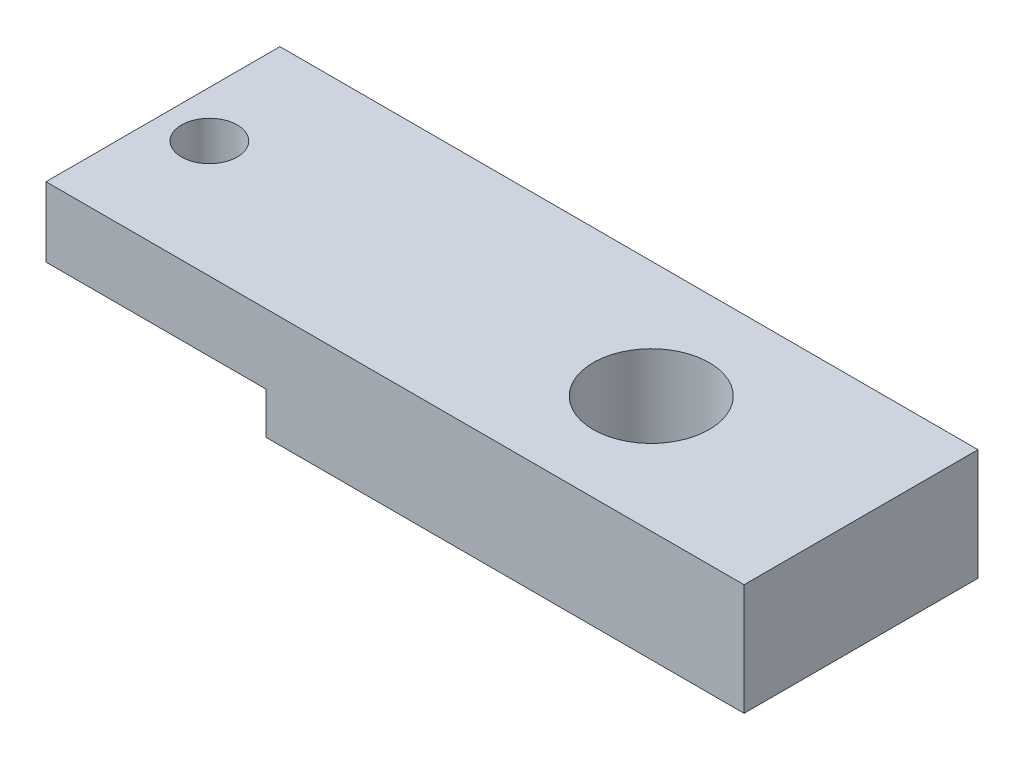
ISO-10303-21;
HEADER;
FILE_DESCRIPTION(('STEP AP214'),'2;1');
FILE_NAME('part.step','',(''),(''),'','','');
FILE_SCHEMA(('AUTOMOTIVE_DESIGN { 1 0 10303 214 1 1 1 1 }'));
ENDSEC;
DATA;
#1=APPLICATION_CONTEXT('core data for automotive mechanical design processes');
#2=APPLICATION_PROTOCOL_DEFINITION('international standard','automotive_design',2000,#1);
#3=PRODUCT_CONTEXT('',#1,'mechanical');
#4=PRODUCT('Part','Part','',(#3));
#5=PRODUCT_RELATED_PRODUCT_CATEGORY('part','',(#4));
#6=PRODUCT_DEFINITION_FORMATION('','',#4);
#7=PRODUCT_DEFINITION_CONTEXT('part definition',#1,'design');
#8=PRODUCT_DEFINITION('design','',#6,#7);
#9=PRODUCT_DEFINITION_SHAPE('','',#8);
#10=(LENGTH_UNIT() NAMED_UNIT(*) SI_UNIT(.MILLI.,.METRE.));
#11=(NAMED_UNIT(*) PLANE_ANGLE_UNIT() SI_UNIT($,.RADIAN.));
#12=(NAMED_UNIT(*) SI_UNIT($,.STERADIAN.) SOLID_ANGLE_UNIT());
#13=UNCERTAINTY_MEASURE_WITH_UNIT(LENGTH_MEASURE(1.E-05),#10,'distance_accuracy_value','');
#14=(GEOMETRIC_REPRESENTATION_CONTEXT(3) GLOBAL_UNCERTAINTY_ASSIGNED_CONTEXT((#13)) GLOBAL_UNIT_ASSIGNED_CONTEXT((#10,
#11,#12)) REPRESENTATION_CONTEXT('',''));
#15=CARTESIAN_POINT('',(0.,0.,0.));
#16=DIRECTION('',(0.,0.,1.));
#17=DIRECTION('',(1.,0.,0.));
#18=AXIS2_PLACEMENT_3D('',#15,#16,#17);
#19=CARTESIAN_POINT('',(0.,0.,0.));
#20=DIRECTION('',(0.,1.,0.));
#21=DIRECTION('',(0.,0.,1.));
#22=AXIS2_PLACEMENT_3D('',#19,#20,#21);
#23=PLANE('',#22);
#24=CARTESIAN_POINT('',(-8.28039999999999,0.,0.));
#25=DIRECTION('',(0.,1.,0.));
#26=DIRECTION('',(0.,0.,1.));
#27=AXIS2_PLACEMENT_3D('',#24,#25,#26);
#28=CIRCLE('',#27,0.761999999999998);
#29=CARTESIAN_POINT('',(-8.28039999999999,0.,0.761999999999998));
#30=VERTEX_POINT('',#29);
#31=EDGE_CURVE('E119',#30,#30,#28,.F.);
#32=ORIENTED_EDGE('',*,*,#31,.F.);
#33=EDGE_LOOP('',(#32));
#34=FACE_BOUND('',#33,.T.);
#35=DIRECTION('',(0.,0.,-1.));
#36=VECTOR('',#35,1.);
#37=CARTESIAN_POINT('',(-3.5306,0.,-3.2004));
#38=LINE('',#37,#36);
#39=CARTESIAN_POINT('',(-3.5306,0.,3.2004));
#40=VERTEX_POINT('',#39);
#41=CARTESIAN_POINT('',(-3.5306,0.,-3.2004));
#42=VERTEX_POINT('',#41);
#43=EDGE_CURVE('E48',#40,#42,#38,.T.);
#44=ORIENTED_EDGE('',*,*,#43,.F.);
#45=DIRECTION('',(1.,0.,0.));
#46=VECTOR('',#45,1.);
#47=CARTESIAN_POINT('',(-9.55039999999999,0.,3.2004));
#48=LINE('',#47,#46);
#49=CARTESIAN_POINT('',(-9.55039999999999,0.,3.2004));
#50=VERTEX_POINT('',#49);
#51=EDGE_CURVE('E132',#50,#40,#48,.T.);
#52=ORIENTED_EDGE('',*,*,#51,.F.);
#53=DIRECTION('',(0.,0.,1.));
#54=VECTOR('',#53,1.);
#55=CARTESIAN_POINT('',(-9.55039999999999,0.,-3.2004));
#56=LINE('',#55,#54);
#57=CARTESIAN_POINT('',(-9.55039999999999,0.,-3.2004));
#58=VERTEX_POINT('',#57);
#59=EDGE_CURVE('E73',#58,#50,#56,.T.);
#60=ORIENTED_EDGE('',*,*,#59,.F.);
#61=DIRECTION('',(-1.,0.,0.));
#62=VECTOR('',#61,1.);
#63=CARTESIAN_POINT('',(-9.55039999999999,0.,-3.2004));
#64=LINE('',#63,#62);
#65=EDGE_CURVE('E130',#42,#58,#64,.T.);
#66=ORIENTED_EDGE('',*,*,#65,.F.);
#67=EDGE_LOOP('',(#44,#52,#60,#66));
#68=FACE_BOUND('',#67,.T.);
#69=ADVANCED_FACE('F33',(#34,#68),#23,.F.);
#70=CARTESIAN_POINT('',(9.5504,1.905,-3.2004));
#71=DIRECTION('',(-1.,0.,0.));
#72=DIRECTION('',(0.,0.,1.));
#73=AXIS2_PLACEMENT_3D('',#70,#71,#72);
#74=PLANE('',#73);
#75=DIRECTION('',(0.,-1.,0.));
#76=VECTOR('',#75,1.);
#77=CARTESIAN_POINT('',(9.5504,1.905,3.2004));
#78=LINE('',#77,#76);
#79=CARTESIAN_POINT('',(9.5504,1.905,3.2004));
#80=VERTEX_POINT('',#79);
#81=CARTESIAN_POINT('',(9.5504,-1.143,3.2004));
#82=VERTEX_POINT('',#81);
#83=EDGE_CURVE('E96',#80,#82,#78,.T.);
#84=ORIENTED_EDGE('',*,*,#83,.T.);
#85=DIRECTION('',(0.,0.,1.));
#86=VECTOR('',#85,1.);
#87=CARTESIAN_POINT('',(9.5504,-1.143,-3.2004));
#88=LINE('',#87,#86);
#89=CARTESIAN_POINT('',(9.5504,-1.143,-3.2004));
#90=VERTEX_POINT('',#89);
#91=EDGE_CURVE('E100',#90,#82,#88,.T.);
#92=ORIENTED_EDGE('',*,*,#91,.F.);
#93=DIRECTION('',(0.,-1.,0.));
#94=VECTOR('',#93,1.);
#95=CARTESIAN_POINT('',(9.5504,1.905,-3.2004));
#96=LINE('',#95,#94);
#97=CARTESIAN_POINT('',(9.5504,1.905,-3.2004));
#98=VERTEX_POINT('',#97);
#99=EDGE_CURVE('E11',#98,#90,#96,.T.);
#100=ORIENTED_EDGE('',*,*,#99,.F.);
#101=DIRECTION('',(0.,0.,-1.));
#102=VECTOR('',#101,1.);
#103=CARTESIAN_POINT('',(9.5504,1.905,-3.2004));
#104=LINE('',#103,#102);
#105=EDGE_CURVE('E101',#80,#98,#104,.T.);
#106=ORIENTED_EDGE('',*,*,#105,.F.);
#107=EDGE_LOOP('',(#84,#92,#100,#106));
#108=FACE_BOUND('',#107,.T.);
#109=ADVANCED_FACE('F35',(#108),#74,.F.);
#110=CARTESIAN_POINT('',(-9.55039999999999,1.905,-3.2004));
#111=DIRECTION('',(0.,0.,1.));
#112=DIRECTION('',(1.,0.,0.));
#113=AXIS2_PLACEMENT_3D('',#110,#111,#112);
#114=PLANE('',#113);
#115=ORIENTED_EDGE('',*,*,#99,.T.);
#116=DIRECTION('',(1.,0.,0.));
#117=VECTOR('',#116,1.);
#118=CARTESIAN_POINT('',(9.5504,-1.143,-3.2004));
#119=LINE('',#118,#117);
#120=CARTESIAN_POINT('',(-3.5306,-1.143,-3.2004));
#121=VERTEX_POINT('',#120);
#122=EDGE_CURVE('E117',#121,#90,#119,.T.);
#123=ORIENTED_EDGE('',*,*,#122,.F.);
#124=DIRECTION('',(0.,1.,0.));
#125=VECTOR('',#124,1.);
#126=CARTESIAN_POINT('',(-3.5306,-1.143,-3.2004));
#127=LINE('',#126,#125);
#128=EDGE_CURVE('E125',#121,#42,#127,.T.);
#129=ORIENTED_EDGE('',*,*,#128,.T.);
#130=ORIENTED_EDGE('',*,*,#65,.T.);
#131=DIRECTION('',(0.,-1.,0.));
#132=VECTOR('',#131,1.);
#133=CARTESIAN_POINT('',(-9.55039999999999,1.905,-3.2004));
#134=LINE('',#133,#132);
#135=CARTESIAN_POINT('',(-9.55039999999999,1.905,-3.2004));
#136=VERTEX_POINT('',#135);
#137=EDGE_CURVE('E41',#136,#58,#134,.T.);
#138=ORIENTED_EDGE('',*,*,#137,.F.);
#139=DIRECTION('',(-1.,0.,0.));
#140=VECTOR('',#139,1.);
#141=CARTESIAN_POINT('',(-9.55039999999999,1.905,-3.2004));
#142=LINE('',#141,#140);
#143=EDGE_CURVE('E80',#98,#136,#142,.T.);
#144=ORIENTED_EDGE('',*,*,#143,.F.);
#145=EDGE_LOOP('',(#115,#123,#129,#130,#138,#144));
#146=FACE_BOUND('',#145,.T.);
#147=ADVANCED_FACE('F145',(#146),#114,.F.);
#148=CARTESIAN_POINT('',(-9.55039999999999,1.905,-3.2004));
#149=DIRECTION('',(1.,0.,0.));
#150=DIRECTION('',(0.,0.,-1.));
#151=AXIS2_PLACEMENT_3D('',#148,#149,#150);
#152=PLANE('',#151);
#153=ORIENTED_EDGE('',*,*,#59,.T.);
#154=DIRECTION('',(0.,-1.,0.));
#155=VECTOR('',#154,1.);
#156=CARTESIAN_POINT('',(-9.55039999999999,1.905,3.2004));
#157=LINE('',#156,#155);
#158=CARTESIAN_POINT('',(-9.55039999999999,1.905,3.2004));
#159=VERTEX_POINT('',#158);
#160=EDGE_CURVE('E103',#159,#50,#157,.T.);
#161=ORIENTED_EDGE('',*,*,#160,.F.);
#162=DIRECTION('',(0.,0.,1.));
#163=VECTOR('',#162,1.);
#164=CARTESIAN_POINT('',(-9.55039999999999,1.905,-3.2004));
#165=LINE('',#164,#163);
#166=EDGE_CURVE('E134',#136,#159,#165,.T.);
#167=ORIENTED_EDGE('',*,*,#166,.F.);
#168=ORIENTED_EDGE('',*,*,#137,.T.);
#169=EDGE_LOOP('',(#153,#161,#167,#168));
#170=FACE_BOUND('',#169,.T.);
#171=ADVANCED_FACE('F141',(#170),#152,.F.);
#172=CARTESIAN_POINT('',(-9.55039999999999,1.905,3.2004));
#173=DIRECTION('',(0.,0.,-1.));
#174=DIRECTION('',(-1.,0.,0.));
#175=AXIS2_PLACEMENT_3D('',#172,#173,#174);
#176=PLANE('',#175);
#177=ORIENTED_EDGE('',*,*,#51,.T.);
#178=DIRECTION('',(0.,1.,0.));
#179=VECTOR('',#178,1.);
#180=CARTESIAN_POINT('',(-3.5306,-1.143,3.2004));
#181=LINE('',#180,#179);
#182=CARTESIAN_POINT('',(-3.5306,-1.143,3.2004));
#183=VERTEX_POINT('',#182);
#184=EDGE_CURVE('E109',#183,#40,#181,.T.);
#185=ORIENTED_EDGE('',*,*,#184,.F.);
#186=DIRECTION('',(-1.,0.,0.));
#187=VECTOR('',#186,1.);
#188=CARTESIAN_POINT('',(9.5504,-1.143,3.2004));
#189=LINE('',#188,#187);
#190=EDGE_CURVE('E106',#82,#183,#189,.T.);
#191=ORIENTED_EDGE('',*,*,#190,.F.);
#192=ORIENTED_EDGE('',*,*,#83,.F.);
#193=DIRECTION('',(1.,0.,0.));
#194=VECTOR('',#193,1.);
#195=CARTESIAN_POINT('',(-9.55039999999999,1.905,3.2004));
#196=LINE('',#195,#194);
#197=EDGE_CURVE('E57',#159,#80,#196,.T.);
#198=ORIENTED_EDGE('',*,*,#197,.F.);
#199=ORIENTED_EDGE('',*,*,#160,.T.);
#200=EDGE_LOOP('',(#177,#185,#191,#192,#198,#199));
#201=FACE_BOUND('',#200,.T.);
#202=ADVANCED_FACE('F107',(#201),#176,.F.);
#203=CARTESIAN_POINT('',(0.,1.905,0.));
#204=DIRECTION('',(0.,1.,0.));
#205=DIRECTION('',(0.,0.,1.));
#206=AXIS2_PLACEMENT_3D('',#203,#204,#205);
#207=PLANE('',#206);
#208=CARTESIAN_POINT('',(3.81,1.905,0.));
#209=DIRECTION('',(0.,1.,0.));
#210=DIRECTION('',(0.,0.,1.));
#211=AXIS2_PLACEMENT_3D('',#208,#209,#210);
#212=CIRCLE('',#211,1.5875);
#213=CARTESIAN_POINT('',(3.81,1.905,1.5875));
#214=VERTEX_POINT('',#213);
#215=EDGE_CURVE('E173',#214,#214,#212,.T.);
#216=ORIENTED_EDGE('',*,*,#215,.F.);
#217=EDGE_LOOP('',(#216));
#218=FACE_BOUND('',#217,.T.);
#219=CARTESIAN_POINT('',(-8.28039999999999,1.905,0.));
#220=DIRECTION('',(0.,1.,0.));
#221=DIRECTION('',(0.,0.,1.));
#222=AXIS2_PLACEMENT_3D('',#219,#220,#221);
#223=CIRCLE('',#222,0.761999999999998);
#224=CARTESIAN_POINT('',(-8.28039999999999,1.905,0.761999999999998));
#225=VERTEX_POINT('',#224);
#226=EDGE_CURVE('E176',#225,#225,#223,.T.);
#227=ORIENTED_EDGE('',*,*,#226,.F.);
#228=EDGE_LOOP('',(#227));
#229=FACE_BOUND('',#228,.T.);
#230=ORIENTED_EDGE('',*,*,#105,.T.);
#231=ORIENTED_EDGE('',*,*,#143,.T.);
#232=ORIENTED_EDGE('',*,*,#166,.T.);
#233=ORIENTED_EDGE('',*,*,#197,.T.);
#234=EDGE_LOOP('',(#230,#231,#232,#233));
#235=FACE_BOUND('',#234,.T.);
#236=ADVANCED_FACE('F160',(#218,#229,#235),#207,.T.);
#237=CARTESIAN_POINT('',(-3.5306,-1.143,-3.2004));
#238=DIRECTION('',(1.,0.,0.));
#239=DIRECTION('',(0.,0.,-1.));
#240=AXIS2_PLACEMENT_3D('',#237,#238,#239);
#241=PLANE('',#240);
#242=ORIENTED_EDGE('',*,*,#43,.T.);
#243=ORIENTED_EDGE('',*,*,#128,.F.);
#244=DIRECTION('',(0.,0.,-1.));
#245=VECTOR('',#244,1.);
#246=CARTESIAN_POINT('',(-3.5306,-1.143,-3.2004));
#247=LINE('',#246,#245);
#248=EDGE_CURVE('E112',#183,#121,#247,.T.);
#249=ORIENTED_EDGE('',*,*,#248,.F.);
#250=ORIENTED_EDGE('',*,*,#184,.T.);
#251=EDGE_LOOP('',(#242,#243,#249,#250));
#252=FACE_BOUND('',#251,.T.);
#253=ADVANCED_FACE('F143',(#252),#241,.F.);
#254=CARTESIAN_POINT('',(0.,-1.143,0.));
#255=DIRECTION('',(0.,-1.,0.));
#256=DIRECTION('',(0.,0.,-1.));
#257=AXIS2_PLACEMENT_3D('',#254,#255,#256);
#258=PLANE('',#257);
#259=CARTESIAN_POINT('',(3.81,-1.143,0.));
#260=DIRECTION('',(0.,-1.,0.));
#261=DIRECTION('',(0.,0.,-1.));
#262=AXIS2_PLACEMENT_3D('',#259,#260,#261);
#263=CIRCLE('',#262,1.5875);
#264=CARTESIAN_POINT('',(3.81,-1.143,-1.5875));
#265=VERTEX_POINT('',#264);
#266=EDGE_CURVE('E179',#265,#265,#263,.F.);
#267=ORIENTED_EDGE('',*,*,#266,.T.);
#268=EDGE_LOOP('',(#267));
#269=FACE_BOUND('',#268,.T.);
#270=ORIENTED_EDGE('',*,*,#91,.T.);
#271=ORIENTED_EDGE('',*,*,#190,.T.);
#272=ORIENTED_EDGE('',*,*,#248,.T.);
#273=ORIENTED_EDGE('',*,*,#122,.T.);
#274=EDGE_LOOP('',(#270,#271,#272,#273));
#275=FACE_BOUND('',#274,.T.);
#276=ADVANCED_FACE('F115',(#269,#275),#258,.T.);
#277=CARTESIAN_POINT('',(-8.28039999999999,-1.144,0.));
#278=DIRECTION('',(0.,1.,0.));
#279=DIRECTION('',(0.,0.,1.));
#280=AXIS2_PLACEMENT_3D('',#277,#278,#279);
#281=CYLINDRICAL_SURFACE('',#280,0.761999999999998);
#282=ORIENTED_EDGE('',*,*,#226,.T.);
#283=EDGE_LOOP('',(#282));
#284=FACE_BOUND('',#283,.T.);
#285=ORIENTED_EDGE('',*,*,#31,.T.);
#286=EDGE_LOOP('',(#285));
#287=FACE_BOUND('',#286,.T.);
#288=ADVANCED_FACE('F189',(#284,#287),#281,.F.);
#289=CARTESIAN_POINT('',(3.81,-1.144,0.));
#290=DIRECTION('',(0.,1.,0.));
#291=DIRECTION('',(0.,0.,1.));
#292=AXIS2_PLACEMENT_3D('',#289,#290,#291);
#293=CYLINDRICAL_SURFACE('',#292,1.5875);
#294=ORIENTED_EDGE('',*,*,#266,.F.);
#295=EDGE_LOOP('',(#294));
#296=FACE_BOUND('',#295,.T.);
#297=ORIENTED_EDGE('',*,*,#215,.T.);
#298=EDGE_LOOP('',(#297));
#299=FACE_BOUND('',#298,.T.);
#300=ADVANCED_FACE('F186',(#296,#299),#293,.F.);
#301=CLOSED_SHELL('',(#69,#109,#147,#171,#202,#236,#253,#276,#288,#300));
#302=MANIFOLD_SOLID_BREP('B2',#301);
#303=ADVANCED_BREP_SHAPE_REPRESENTATION('',(#18,#302),#14);
#304=SHAPE_DEFINITION_REPRESENTATION(#9,#303);
ENDSEC;
END-ISO-10303-21;
